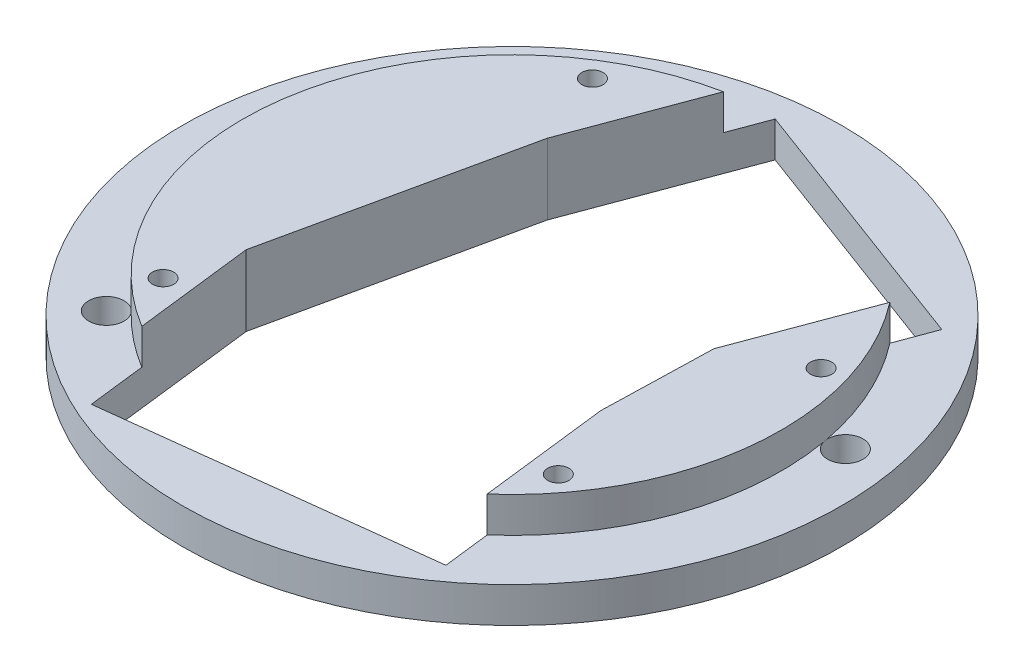
ISO-10303-21;
HEADER;
FILE_DESCRIPTION(('STEP AP214'),'2;1');
FILE_NAME('part.step','',(''),(''),'','','');
FILE_SCHEMA(('AUTOMOTIVE_DESIGN { 1 0 10303 214 1 1 1 1 }'));
ENDSEC;
DATA;
#1=APPLICATION_CONTEXT('core data for automotive mechanical design processes');
#2=APPLICATION_PROTOCOL_DEFINITION('international standard','automotive_design',2000,#1);
#3=PRODUCT_CONTEXT('',#1,'mechanical');
#4=PRODUCT('Part','Part','',(#3));
#5=PRODUCT_RELATED_PRODUCT_CATEGORY('part','',(#4));
#6=PRODUCT_DEFINITION_FORMATION('','',#4);
#7=PRODUCT_DEFINITION_CONTEXT('part definition',#1,'design');
#8=PRODUCT_DEFINITION('design','',#6,#7);
#9=PRODUCT_DEFINITION_SHAPE('','',#8);
#10=(LENGTH_UNIT() NAMED_UNIT(*) SI_UNIT(.MILLI.,.METRE.));
#11=(NAMED_UNIT(*) PLANE_ANGLE_UNIT() SI_UNIT($,.RADIAN.));
#12=(NAMED_UNIT(*) SI_UNIT($,.STERADIAN.) SOLID_ANGLE_UNIT());
#13=UNCERTAINTY_MEASURE_WITH_UNIT(LENGTH_MEASURE(1.E-05),#10,'distance_accuracy_value','');
#14=(GEOMETRIC_REPRESENTATION_CONTEXT(3) GLOBAL_UNCERTAINTY_ASSIGNED_CONTEXT((#13)) GLOBAL_UNIT_ASSIGNED_CONTEXT((#10,
#11,#12)) REPRESENTATION_CONTEXT('',''));
#15=CARTESIAN_POINT('',(0.,0.,0.));
#16=DIRECTION('',(0.,0.,1.));
#17=DIRECTION('',(1.,0.,0.));
#18=AXIS2_PLACEMENT_3D('',#15,#16,#17);
#19=CARTESIAN_POINT('',(-2.83521131428288,10.,0.));
#20=DIRECTION('',(0.,1.,0.));
#21=DIRECTION('',(0.,0.,1.));
#22=AXIS2_PLACEMENT_3D('',#19,#20,#21);
#23=PLANE('',#22);
#24=DIRECTION('',(0.0271610970881817,0.,-0.99963106934757));
#25=VECTOR('',#24,1.);
#26=CARTESIAN_POINT('',(20.4650387311431,10.,-5.1898694392139));
#27=LINE('',#26,#25);
#28=CARTESIAN_POINT('',(20.042712500142,10.,10.3533326832382));
#29=VERTEX_POINT('',#28);
#30=CARTESIAN_POINT('',(20.4650387311431,10.,-5.1898694392139));
#31=VERTEX_POINT('',#30);
#32=EDGE_CURVE('E160',#29,#31,#27,.T.);
#33=ORIENTED_EDGE('',*,*,#32,.F.);
#34=DIRECTION('',(-0.118896593610354,0.,-0.992906642151141));
#35=VECTOR('',#34,1.);
#36=CARTESIAN_POINT('',(18.4970567832074,10.,-2.55445366472666));
#37=LINE('',#36,#35);
#38=CARTESIAN_POINT('',(22.2236809974988,10.,28.5666224133433));
#39=VERTEX_POINT('',#38);
#40=EDGE_CURVE('E13',#39,#29,#37,.T.);
#41=ORIENTED_EDGE('',*,*,#40,.F.);
#42=CARTESIAN_POINT('',(-2.83521131428288,10.,0.));
#43=DIRECTION('',(0.,1.,0.));
#44=DIRECTION('',(0.,0.,1.));
#45=AXIS2_PLACEMENT_3D('',#42,#43,#44);
#46=CIRCLE('',#45,38.);
#47=CARTESIAN_POINT('',(27.204272032586,10.,-23.2729336408882));
#48=VERTEX_POINT('',#47);
#49=EDGE_CURVE('E255',#39,#48,#46,.T.);
#50=ORIENTED_EDGE('',*,*,#49,.T.);
#51=DIRECTION('',(0.34921847701237,0.,-0.937041330632305));
#52=VECTOR('',#51,1.);
#53=CARTESIAN_POINT('',(29.1955006564524,10.,-28.6159027050215));
#54=LINE('',#53,#52);
#55=EDGE_CURVE('E187',#31,#48,#54,.T.);
#56=ORIENTED_EDGE('',*,*,#55,.F.);
#57=EDGE_LOOP('',(#33,#41,#50,#56));
#58=FACE_BOUND('',#57,.T.);
#59=CARTESIAN_POINT('',(24.8337846457272,10.,21.1365462089214));
#60=DIRECTION('',(0.,1.,0.));
#61=DIRECTION('',(0.,0.,1.));
#62=AXIS2_PLACEMENT_3D('',#59,#60,#61);
#63=CIRCLE('',#62,1.5);
#64=CARTESIAN_POINT('',(24.8337846457272,10.,22.6365462089214));
#65=VERTEX_POINT('',#64);
#66=EDGE_CURVE('E219',#65,#65,#63,.T.);
#67=ORIENTED_EDGE('',*,*,#66,.F.);
#68=EDGE_LOOP('',(#67));
#69=FACE_BOUND('',#68,.T.);
#70=CARTESIAN_POINT('',(30.4014959552903,10.,-10.3753656780677));
#71=DIRECTION('',(0.,1.,0.));
#72=DIRECTION('',(0.,0.,1.));
#73=AXIS2_PLACEMENT_3D('',#70,#71,#72);
#74=CIRCLE('',#73,1.5);
#75=CARTESIAN_POINT('',(30.4014959552903,10.,-8.87536567806766));
#76=VERTEX_POINT('',#75);
#77=EDGE_CURVE('E213',#76,#76,#74,.T.);
#78=ORIENTED_EDGE('',*,*,#77,.F.);
#79=EDGE_LOOP('',(#78));
#80=FACE_BOUND('',#79,.T.);
#81=ADVANCED_FACE('F44',(#58,#69,#80),#23,.T.);
#82=CARTESIAN_POINT('',(-2.83521131428288,10.,0.));
#83=DIRECTION('',(0.,-1.,0.));
#84=DIRECTION('',(0.,0.,-1.));
#85=AXIS2_PLACEMENT_3D('',#82,#83,#84);
#86=CYLINDRICAL_SURFACE('',#85,38.);
#87=ORIENTED_EDGE('',*,*,#49,.F.);
#88=DIRECTION('',(0.,-1.,0.));
#89=VECTOR('',#88,1.);
#90=CARTESIAN_POINT('',(22.2236809974988,10.,28.5666224133433));
#91=LINE('',#90,#89);
#92=CARTESIAN_POINT('',(22.2236809974988,5.,28.5666224133433));
#93=VERTEX_POINT('',#92);
#94=EDGE_CURVE('E393',#39,#93,#91,.T.);
#95=ORIENTED_EDGE('',*,*,#94,.T.);
#96=CARTESIAN_POINT('',(-2.83521131428288,5.,0.));
#97=DIRECTION('',(0.,1.,0.));
#98=DIRECTION('',(0.,0.,1.));
#99=AXIS2_PLACEMENT_3D('',#96,#97,#98);
#100=CIRCLE('',#99,38.);
#101=CARTESIAN_POINT('',(34.6121261363601,5.,-6.45731506569657));
#102=VERTEX_POINT('',#101);
#103=EDGE_CURVE('E260',#93,#102,#100,.T.);
#104=ORIENTED_EDGE('',*,*,#103,.T.);
#105=CARTESIAN_POINT('',(34.5027051133886,5.,-7.06257720950504));
#106=VERTEX_POINT('',#105);
#107=EDGE_CURVE('E359',#102,#106,#100,.T.);
#108=ORIENTED_EDGE('',*,*,#107,.T.);
#109=CARTESIAN_POINT('',(27.204272032586,5.,-23.2729336408882));
#110=VERTEX_POINT('',#109);
#111=EDGE_CURVE('E357',#106,#110,#100,.T.);
#112=ORIENTED_EDGE('',*,*,#111,.T.);
#113=DIRECTION('',(0.,-1.,0.));
#114=VECTOR('',#113,1.);
#115=CARTESIAN_POINT('',(27.204272032586,10.,-23.2729336408882));
#116=LINE('',#115,#114);
#117=EDGE_CURVE('E170',#110,#48,#116,.F.);
#118=ORIENTED_EDGE('',*,*,#117,.T.);
#119=EDGE_LOOP('',(#87,#95,#104,#108,#112,#118));
#120=FACE_BOUND('',#119,.T.);
#121=ADVANCED_FACE('F278',(#120),#86,.T.);
#122=CARTESIAN_POINT('',(-2.83521131428288,5.,0.));
#123=DIRECTION('',(0.,-1.,0.));
#124=DIRECTION('',(0.,0.,-1.));
#125=AXIS2_PLACEMENT_3D('',#122,#123,#124);
#126=CYLINDRICAL_SURFACE('',#125,46.5);
#127=CARTESIAN_POINT('',(-2.83521131428288,5.,0.));
#128=DIRECTION('',(0.,1.,0.));
#129=DIRECTION('',(0.,0.,1.));
#130=AXIS2_PLACEMENT_3D('',#127,#128,#129);
#131=CIRCLE('',#130,46.5);
#132=CARTESIAN_POINT('',(-2.83521131428288,5.,46.5));
#133=VERTEX_POINT('',#132);
#134=EDGE_CURVE('E261',#133,#133,#131,.T.);
#135=ORIENTED_EDGE('',*,*,#134,.F.);
#136=EDGE_LOOP('',(#135));
#137=FACE_BOUND('',#136,.T.);
#138=CARTESIAN_POINT('',(-2.83521131428288,0.,0.));
#139=DIRECTION('',(0.,1.,0.));
#140=DIRECTION('',(0.,0.,1.));
#141=AXIS2_PLACEMENT_3D('',#138,#139,#140);
#142=CIRCLE('',#141,46.5);
#143=CARTESIAN_POINT('',(-2.83521131428288,0.,46.5));
#144=VERTEX_POINT('',#143);
#145=EDGE_CURVE('E254',#144,#144,#142,.T.);
#146=ORIENTED_EDGE('',*,*,#145,.T.);
#147=EDGE_LOOP('',(#146));
#148=FACE_BOUND('',#147,.T.);
#149=ADVANCED_FACE('F46',(#137,#148),#126,.T.);
#150=CARTESIAN_POINT('',(-2.83521131428288,5.,0.));
#151=DIRECTION('',(0.,1.,0.));
#152=DIRECTION('',(0.,0.,1.));
#153=AXIS2_PLACEMENT_3D('',#150,#151,#152);
#154=PLANE('',#153);
#155=DIRECTION('',(-0.118896593610354,0.,-0.992906642151141));
#156=VECTOR('',#155,1.);
#157=CARTESIAN_POINT('',(18.4970567832074,5.,-2.55445366472666));
#158=LINE('',#157,#156);
#159=CARTESIAN_POINT('',(23.0151273404009,5.,35.1759987370167));
#160=VERTEX_POINT('',#159);
#161=EDGE_CURVE('E189',#160,#93,#158,.T.);
#162=ORIENTED_EDGE('',*,*,#161,.F.);
#163=DIRECTION('',(0.992906642151141,0.,-0.118896593610354));
#164=VECTOR('',#163,1.);
#165=CARTESIAN_POINT('',(1.68285924291057,5.,37.7304524017434));
#166=LINE('',#165,#164);
#167=CARTESIAN_POINT('',(-21.6656715564005,5.,40.5263454494826));
#168=VERTEX_POINT('',#167);
#169=EDGE_CURVE('E385',#168,#160,#166,.T.);
#170=ORIENTED_EDGE('',*,*,#169,.F.);
#171=DIRECTION('',(0.118896593610354,0.,0.992906642151141));
#172=VECTOR('',#171,1.);
#173=CARTESIAN_POINT('',(-26.1837421135939,5.,2.79589304773927));
#174=LINE('',#173,#172);
#175=CARTESIAN_POINT('',(-22.6346656667726,5.,32.4342659442706));
#176=VERTEX_POINT('',#175);
#177=EDGE_CURVE('E382',#176,#168,#174,.T.);
#178=ORIENTED_EDGE('',*,*,#177,.F.);
#179=CARTESIAN_POINT('',(-30.0169888186709,5.,26.5546789041394));
#180=VERTEX_POINT('',#179);
#181=EDGE_CURVE('E360',#180,#176,#100,.T.);
#182=ORIENTED_EDGE('',*,*,#181,.F.);
#183=CARTESIAN_POINT('',(-32.0187761800075,5.,28.0522927929615));
#184=DIRECTION('',(0.,1.,0.));
#185=DIRECTION('',(0.,0.,1.));
#186=AXIS2_PLACEMENT_3D('',#183,#184,#185);
#187=CIRCLE('',#186,2.5);
#188=CARTESIAN_POINT('',(-30.4432318195107,5.,26.1112466914723));
#189=VERTEX_POINT('',#188);
#190=EDGE_CURVE('E241',#189,#180,#187,.T.);
#191=ORIENTED_EDGE('',*,*,#190,.F.);
#192=CARTESIAN_POINT('',(-20.3941624962256,5.,-33.6998996050456));
#193=VERTEX_POINT('',#192);
#194=EDGE_CURVE('E259',#193,#189,#100,.T.);
#195=ORIENTED_EDGE('',*,*,#194,.F.);
#196=CARTESIAN_POINT('',(-21.2488615842367,5.,-36.0492589792055));
#197=DIRECTION('',(0.,1.,0.));
#198=DIRECTION('',(0.,0.,1.));
#199=AXIS2_PLACEMENT_3D('',#196,#197,#198);
#200=CIRCLE('',#199,2.5);
#201=CARTESIAN_POINT('',(-19.8464088976606,5.,-33.9796874143846));
#202=VERTEX_POINT('',#201);
#203=EDGE_CURVE('E233',#202,#193,#200,.T.);
#204=ORIENTED_EDGE('',*,*,#203,.F.);
#205=CARTESIAN_POINT('',(-10.2683156977392,5.,-37.2659222242606));
#206=VERTEX_POINT('',#205);
#207=EDGE_CURVE('E247',#206,#202,#100,.T.);
#208=ORIENTED_EDGE('',*,*,#207,.F.);
#209=DIRECTION('',(-0.34921847701237,0.,0.937041330632305));
#210=VECTOR('',#209,1.);
#211=CARTESIAN_POINT('',(-21.5564299864638,5.,-6.97706201294549));
#212=LINE('',#211,#210);
#213=CARTESIAN_POINT('',(-8.28612785999372,5.,-42.5846325769731));
#214=VERTEX_POINT('',#213);
#215=EDGE_CURVE('E203',#214,#206,#212,.T.);
#216=ORIENTED_EDGE('',*,*,#215,.F.);
#217=DIRECTION('',(-0.937041330632305,0.,-0.34921847701237));
#218=VECTOR('',#217,1.);
#219=CARTESIAN_POINT('',(10.4350908121872,5.,-35.6075705640276));
#220=LINE('',#219,#218);
#221=CARTESIAN_POINT('',(29.1955006564524,5.,-28.6159027050215));
#222=VERTEX_POINT('',#221);
#223=EDGE_CURVE('E198',#222,#214,#220,.T.);
#224=ORIENTED_EDGE('',*,*,#223,.F.);
#225=DIRECTION('',(0.34921847701237,0.,-0.937041330632305));
#226=VECTOR('',#225,1.);
#227=CARTESIAN_POINT('',(15.9251985299823,5.,6.99166785900607));
#228=LINE('',#227,#226);
#229=EDGE_CURVE('E196',#110,#222,#228,.T.);
#230=ORIENTED_EDGE('',*,*,#229,.F.);
#231=ORIENTED_EDGE('',*,*,#111,.F.);
#232=CARTESIAN_POINT('',(36.9988524501873,5.,-7.20131607569916));
#233=DIRECTION('',(0.,1.,0.));
#234=DIRECTION('',(0.,0.,1.));
#235=AXIS2_PLACEMENT_3D('',#232,#233,#234);
#236=CIRCLE('',#235,2.5);
#237=EDGE_CURVE('E234',#102,#106,#236,.T.);
#238=ORIENTED_EDGE('',*,*,#237,.F.);
#239=ORIENTED_EDGE('',*,*,#103,.F.);
#240=EDGE_LOOP('',(#162,#170,#178,#182,#191,#195,#204,#208,#216,#224,#230,#231,#238,#239));
#241=FACE_BOUND('',#240,.T.);
#242=ORIENTED_EDGE('',*,*,#134,.T.);
#243=EDGE_LOOP('',(#242));
#244=FACE_BOUND('',#243,.T.);
#245=ADVANCED_FACE('F270',(#241,#244),#154,.T.);
#246=CARTESIAN_POINT('',(-2.83521131428288,0.,0.));
#247=DIRECTION('',(0.,1.,0.));
#248=DIRECTION('',(0.,0.,1.));
#249=AXIS2_PLACEMENT_3D('',#246,#247,#248);
#250=PLANE('',#249);
#251=DIRECTION('',(-0.118896593610354,0.,-0.992906642151141));
#252=VECTOR('',#251,1.);
#253=CARTESIAN_POINT('',(23.0151273404009,0.,35.1759987370167));
#254=LINE('',#253,#252);
#255=CARTESIAN_POINT('',(23.0151273404009,0.,35.1759987370167));
#256=VERTEX_POINT('',#255);
#257=CARTESIAN_POINT('',(20.042712500142,0.,10.3533326832382));
#258=VERTEX_POINT('',#257);
#259=EDGE_CURVE('E408',#256,#258,#254,.T.);
#260=ORIENTED_EDGE('',*,*,#259,.T.);
#261=DIRECTION('',(0.0271610970881817,0.,-0.99963106934757));
#262=VECTOR('',#261,1.);
#263=CARTESIAN_POINT('',(20.4650387311431,0.,-5.1898694392139));
#264=LINE('',#263,#262);
#265=CARTESIAN_POINT('',(20.4650387311431,0.,-5.1898694392139));
#266=VERTEX_POINT('',#265);
#267=EDGE_CURVE('E159',#258,#266,#264,.T.);
#268=ORIENTED_EDGE('',*,*,#267,.T.);
#269=DIRECTION('',(0.34921847701237,0.,-0.937041330632305));
#270=VECTOR('',#269,1.);
#271=CARTESIAN_POINT('',(29.1955006564524,0.,-28.6159027050215));
#272=LINE('',#271,#270);
#273=CARTESIAN_POINT('',(29.1955006564524,0.,-28.6159027050215));
#274=VERTEX_POINT('',#273);
#275=EDGE_CURVE('E183',#266,#274,#272,.T.);
#276=ORIENTED_EDGE('',*,*,#275,.T.);
#277=DIRECTION('',(-0.937041330632305,0.,-0.34921847701237));
#278=VECTOR('',#277,1.);
#279=CARTESIAN_POINT('',(-8.28612785999372,0.,-42.5846325769731));
#280=LINE('',#279,#278);
#281=CARTESIAN_POINT('',(-8.28612785999372,0.,-42.5846325769731));
#282=VERTEX_POINT('',#281);
#283=EDGE_CURVE('E177',#274,#282,#280,.T.);
#284=ORIENTED_EDGE('',*,*,#283,.T.);
#285=DIRECTION('',(-0.34921847701237,0.,0.937041330632305));
#286=VECTOR('',#285,1.);
#287=CARTESIAN_POINT('',(-17.016589785303,0.,-19.1585993111655));
#288=LINE('',#287,#286);
#289=CARTESIAN_POINT('',(-17.016589785303,0.,-19.1585993111655));
#290=VERTEX_POINT('',#289);
#291=EDGE_CURVE('E167',#282,#290,#288,.T.);
#292=ORIENTED_EDGE('',*,*,#291,.T.);
#293=DIRECTION('',(-0.213573142088404,0.,0.976927076591946));
#294=VECTOR('',#293,1.);
#295=CARTESIAN_POINT('',(-17.016589785303,0.,-19.1585993111655));
#296=LINE('',#295,#294);
#297=CARTESIAN_POINT('',(-24.6380863966593,0.,15.7036793957041));
#298=VERTEX_POINT('',#297);
#299=EDGE_CURVE('E150',#290,#298,#296,.T.);
#300=ORIENTED_EDGE('',*,*,#299,.T.);
#301=DIRECTION('',(0.118896593610354,0.,0.992906642151141));
#302=VECTOR('',#301,1.);
#303=CARTESIAN_POINT('',(-24.6380863966593,0.,15.7036793957041));
#304=LINE('',#303,#302);
#305=CARTESIAN_POINT('',(-21.6656715564005,0.,40.5263454494826));
#306=VERTEX_POINT('',#305);
#307=EDGE_CURVE('E412',#298,#306,#304,.T.);
#308=ORIENTED_EDGE('',*,*,#307,.T.);
#309=DIRECTION('',(0.992906642151141,0.,-0.118896593610354));
#310=VECTOR('',#309,1.);
#311=CARTESIAN_POINT('',(-21.6656715564005,0.,40.5263454494826));
#312=LINE('',#311,#310);
#313=EDGE_CURVE('E59',#306,#256,#312,.T.);
#314=ORIENTED_EDGE('',*,*,#313,.T.);
#315=EDGE_LOOP('',(#260,#268,#276,#284,#292,#300,#308,#314));
#316=FACE_BOUND('',#315,.T.);
#317=CARTESIAN_POINT('',(-21.1169446181786,0.,-29.6328390553817));
#318=DIRECTION('',(0.,1.,0.));
#319=DIRECTION('',(0.,0.,1.));
#320=AXIS2_PLACEMENT_3D('',#317,#318,#319);
#321=CIRCLE('',#320,1.5);
#322=CARTESIAN_POINT('',(-21.1169446181786,0.,-28.1328390553817));
#323=VERTEX_POINT('',#322);
#324=EDGE_CURVE('E210',#323,#323,#321,.T.);
#325=ORIENTED_EDGE('',*,*,#324,.T.);
#326=EDGE_LOOP('',(#325));
#327=FACE_BOUND('',#326,.T.);
#328=CARTESIAN_POINT('',(30.4014959552903,0.,-10.3753656780677));
#329=DIRECTION('',(0.,1.,0.));
#330=DIRECTION('',(0.,0.,1.));
#331=AXIS2_PLACEMENT_3D('',#328,#329,#330);
#332=CIRCLE('',#331,1.5);
#333=CARTESIAN_POINT('',(30.4014959552903,0.,-8.87536567806766));
#334=VERTEX_POINT('',#333);
#335=EDGE_CURVE('E216',#334,#334,#332,.T.);
#336=ORIENTED_EDGE('',*,*,#335,.T.);
#337=EDGE_LOOP('',(#336));
#338=FACE_BOUND('',#337,.T.);
#339=CARTESIAN_POINT('',(24.8337846457272,0.,21.1365462089214));
#340=DIRECTION('',(0.,1.,0.));
#341=DIRECTION('',(0.,0.,1.));
#342=AXIS2_PLACEMENT_3D('',#339,#340,#341);
#343=CIRCLE('',#342,1.5);
#344=CARTESIAN_POINT('',(24.8337846457272,0.,22.6365462089214));
#345=VERTEX_POINT('',#344);
#346=EDGE_CURVE('E205',#345,#345,#343,.T.);
#347=ORIENTED_EDGE('',*,*,#346,.T.);
#348=EDGE_LOOP('',(#347));
#349=FACE_BOUND('',#348,.T.);
#350=CARTESIAN_POINT('',(-27.0187761800075,0.,25.049593079773));
#351=DIRECTION('',(0.,1.,0.));
#352=DIRECTION('',(0.,0.,1.));
#353=AXIS2_PLACEMENT_3D('',#350,#351,#352);
#354=CIRCLE('',#353,1.5);
#355=CARTESIAN_POINT('',(-27.0187761800075,0.,26.549593079773));
#356=VERTEX_POINT('',#355);
#357=EDGE_CURVE('E224',#356,#356,#354,.T.);
#358=ORIENTED_EDGE('',*,*,#357,.T.);
#359=EDGE_LOOP('',(#358));
#360=FACE_BOUND('',#359,.T.);
#361=CARTESIAN_POINT('',(36.9988524501873,0.,-7.20131607569916));
#362=DIRECTION('',(0.,1.,0.));
#363=DIRECTION('',(0.,0.,1.));
#364=AXIS2_PLACEMENT_3D('',#361,#362,#363);
#365=CIRCLE('',#364,2.5);
#366=CARTESIAN_POINT('',(36.9988524501873,0.,-4.70131607569916));
#367=VERTEX_POINT('',#366);
#368=EDGE_CURVE('E235',#367,#367,#365,.T.);
#369=ORIENTED_EDGE('',*,*,#368,.T.);
#370=EDGE_LOOP('',(#369));
#371=FACE_BOUND('',#370,.T.);
#372=CARTESIAN_POINT('',(-32.0187761800075,0.,28.0522927929615));
#373=DIRECTION('',(0.,1.,0.));
#374=DIRECTION('',(0.,0.,1.));
#375=AXIS2_PLACEMENT_3D('',#372,#373,#374);
#376=CIRCLE('',#375,2.5);
#377=CARTESIAN_POINT('',(-32.0187761800075,0.,30.5522927929615));
#378=VERTEX_POINT('',#377);
#379=EDGE_CURVE('E227',#378,#378,#376,.T.);
#380=ORIENTED_EDGE('',*,*,#379,.T.);
#381=EDGE_LOOP('',(#380));
#382=FACE_BOUND('',#381,.T.);
#383=CARTESIAN_POINT('',(-21.2488615842367,0.,-36.0492589792055));
#384=DIRECTION('',(0.,1.,0.));
#385=DIRECTION('',(0.,0.,1.));
#386=AXIS2_PLACEMENT_3D('',#383,#384,#385);
#387=CIRCLE('',#386,2.5);
#388=CARTESIAN_POINT('',(-21.2488615842367,0.,-33.5492589792055));
#389=VERTEX_POINT('',#388);
#390=EDGE_CURVE('E244',#389,#389,#387,.T.);
#391=ORIENTED_EDGE('',*,*,#390,.T.);
#392=EDGE_LOOP('',(#391));
#393=FACE_BOUND('',#392,.T.);
#394=ORIENTED_EDGE('',*,*,#145,.F.);
#395=EDGE_LOOP('',(#394));
#396=FACE_BOUND('',#395,.T.);
#397=ADVANCED_FACE('F174',(#316,#327,#338,#349,#360,#371,#382,#393,#396),#250,.F.);
#398=ORIENTED_EDGE('',*,*,#181,.T.);
#399=DIRECTION('',(0.,-1.,0.));
#400=VECTOR('',#399,1.);
#401=CARTESIAN_POINT('',(-22.6346656667726,10.,32.4342659442706));
#402=LINE('',#401,#400);
#403=CARTESIAN_POINT('',(-22.6346656667726,10.,32.4342659442706));
#404=VERTEX_POINT('',#403);
#405=EDGE_CURVE('E379',#176,#404,#402,.F.);
#406=ORIENTED_EDGE('',*,*,#405,.T.);
#407=CARTESIAN_POINT('',(-10.2683156977392,10.,-37.2659222242606));
#408=VERTEX_POINT('',#407);
#409=EDGE_CURVE('E251',#408,#404,#46,.T.);
#410=ORIENTED_EDGE('',*,*,#409,.F.);
#411=DIRECTION('',(0.,-1.,0.));
#412=VECTOR('',#411,1.);
#413=CARTESIAN_POINT('',(-10.2683156977392,10.,-37.2659222242606));
#414=LINE('',#413,#412);
#415=EDGE_CURVE('E200',#408,#206,#414,.T.);
#416=ORIENTED_EDGE('',*,*,#415,.T.);
#417=ORIENTED_EDGE('',*,*,#207,.T.);
#418=EDGE_CURVE('E256',#202,#193,#100,.T.);
#419=ORIENTED_EDGE('',*,*,#418,.T.);
#420=ORIENTED_EDGE('',*,*,#194,.T.);
#421=EDGE_CURVE('E354',#189,#180,#100,.T.);
#422=ORIENTED_EDGE('',*,*,#421,.T.);
#423=EDGE_LOOP('',(#398,#406,#410,#416,#417,#419,#420,#422));
#424=FACE_BOUND('',#423,.T.);
#425=ADVANCED_FACE('F269',(#424),#86,.T.);
#426=DIRECTION('',(-0.213573142088404,0.,0.976927076591946));
#427=VECTOR('',#426,1.);
#428=CARTESIAN_POINT('',(-17.016589785303,10.,-19.1585993111655));
#429=LINE('',#428,#427);
#430=CARTESIAN_POINT('',(-17.016589785303,10.,-19.1585993111655));
#431=VERTEX_POINT('',#430);
#432=CARTESIAN_POINT('',(-24.6380863966593,10.,15.7036793957041));
#433=VERTEX_POINT('',#432);
#434=EDGE_CURVE('E67',#431,#433,#429,.T.);
#435=ORIENTED_EDGE('',*,*,#434,.F.);
#436=DIRECTION('',(-0.34921847701237,0.,0.937041330632305));
#437=VECTOR('',#436,1.);
#438=CARTESIAN_POINT('',(-21.5564299864638,10.,-6.97706201294549));
#439=LINE('',#438,#437);
#440=EDGE_CURVE('E52',#408,#431,#439,.T.);
#441=ORIENTED_EDGE('',*,*,#440,.F.);
#442=ORIENTED_EDGE('',*,*,#409,.T.);
#443=DIRECTION('',(0.118896593610354,0.,0.992906642151141));
#444=VECTOR('',#443,1.);
#445=CARTESIAN_POINT('',(-24.6380863966593,10.,15.7036793957041));
#446=LINE('',#445,#444);
#447=EDGE_CURVE('E410',#433,#404,#446,.T.);
#448=ORIENTED_EDGE('',*,*,#447,.F.);
#449=EDGE_LOOP('',(#435,#441,#442,#448));
#450=FACE_BOUND('',#449,.T.);
#451=CARTESIAN_POINT('',(-21.1169446181786,10.,-29.6328390553817));
#452=DIRECTION('',(0.,1.,0.));
#453=DIRECTION('',(0.,0.,1.));
#454=AXIS2_PLACEMENT_3D('',#451,#452,#453);
#455=CIRCLE('',#454,1.5);
#456=CARTESIAN_POINT('',(-21.1169446181786,10.,-28.1328390553817));
#457=VERTEX_POINT('',#456);
#458=EDGE_CURVE('E206',#457,#457,#455,.T.);
#459=ORIENTED_EDGE('',*,*,#458,.F.);
#460=EDGE_LOOP('',(#459));
#461=FACE_BOUND('',#460,.T.);
#462=CARTESIAN_POINT('',(-27.0187761800075,10.,25.049593079773));
#463=DIRECTION('',(0.,1.,0.));
#464=DIRECTION('',(0.,0.,1.));
#465=AXIS2_PLACEMENT_3D('',#462,#463,#464);
#466=CIRCLE('',#465,1.5);
#467=CARTESIAN_POINT('',(-27.0187761800075,10.,26.549593079773));
#468=VERTEX_POINT('',#467);
#469=EDGE_CURVE('E209',#468,#468,#466,.T.);
#470=ORIENTED_EDGE('',*,*,#469,.F.);
#471=EDGE_LOOP('',(#470));
#472=FACE_BOUND('',#471,.T.);
#473=ADVANCED_FACE('F275',(#450,#461,#472),#23,.T.);
#474=CARTESIAN_POINT('',(-21.2488615842367,5.,-36.0492589792055));
#475=DIRECTION('',(0.,1.,0.));
#476=DIRECTION('',(0.,0.,1.));
#477=AXIS2_PLACEMENT_3D('',#474,#475,#476);
#478=PLANE('',#477);
#479=EDGE_CURVE('E248',#193,#202,#200,.T.);
#480=ORIENTED_EDGE('',*,*,#479,.F.);
#481=ORIENTED_EDGE('',*,*,#418,.F.);
#482=EDGE_LOOP('',(#480,#481));
#483=FACE_BOUND('',#482,.T.);
#484=ADVANCED_FACE('F292',(#483),#478,.F.);
#485=CARTESIAN_POINT('',(-21.2488615842367,0.,-36.0492589792055));
#486=DIRECTION('',(0.,1.,0.));
#487=DIRECTION('',(0.,0.,1.));
#488=AXIS2_PLACEMENT_3D('',#485,#486,#487);
#489=CYLINDRICAL_SURFACE('',#488,2.5);
#490=ORIENTED_EDGE('',*,*,#390,.F.);
#491=EDGE_LOOP('',(#490));
#492=FACE_BOUND('',#491,.T.);
#493=ORIENTED_EDGE('',*,*,#479,.T.);
#494=ORIENTED_EDGE('',*,*,#203,.T.);
#495=EDGE_LOOP('',(#493,#494));
#496=FACE_BOUND('',#495,.T.);
#497=ADVANCED_FACE('F297',(#492,#496),#489,.F.);
#498=CARTESIAN_POINT('',(-32.0187761800075,5.,28.0522927929615));
#499=DIRECTION('',(0.,1.,0.));
#500=DIRECTION('',(0.,0.,1.));
#501=AXIS2_PLACEMENT_3D('',#498,#499,#500);
#502=PLANE('',#501);
#503=EDGE_CURVE('E238',#180,#189,#187,.T.);
#504=ORIENTED_EDGE('',*,*,#503,.F.);
#505=ORIENTED_EDGE('',*,*,#421,.F.);
#506=EDGE_LOOP('',(#504,#505));
#507=FACE_BOUND('',#506,.T.);
#508=ADVANCED_FACE('F331',(#507),#502,.F.);
#509=CARTESIAN_POINT('',(-32.0187761800075,0.,28.0522927929615));
#510=DIRECTION('',(0.,1.,0.));
#511=DIRECTION('',(0.,0.,1.));
#512=AXIS2_PLACEMENT_3D('',#509,#510,#511);
#513=CYLINDRICAL_SURFACE('',#512,2.5);
#514=ORIENTED_EDGE('',*,*,#379,.F.);
#515=EDGE_LOOP('',(#514));
#516=FACE_BOUND('',#515,.T.);
#517=ORIENTED_EDGE('',*,*,#503,.T.);
#518=ORIENTED_EDGE('',*,*,#190,.T.);
#519=EDGE_LOOP('',(#517,#518));
#520=FACE_BOUND('',#519,.T.);
#521=ADVANCED_FACE('F327',(#516,#520),#513,.F.);
#522=CARTESIAN_POINT('',(36.9988524501873,5.,-7.20131607569916));
#523=DIRECTION('',(0.,1.,0.));
#524=DIRECTION('',(0.,0.,1.));
#525=AXIS2_PLACEMENT_3D('',#522,#523,#524);
#526=PLANE('',#525);
#527=EDGE_CURVE('E230',#106,#102,#236,.T.);
#528=ORIENTED_EDGE('',*,*,#527,.F.);
#529=ORIENTED_EDGE('',*,*,#107,.F.);
#530=EDGE_LOOP('',(#528,#529));
#531=FACE_BOUND('',#530,.T.);
#532=ADVANCED_FACE('F319',(#531),#526,.F.);
#533=CARTESIAN_POINT('',(36.9988524501873,0.,-7.20131607569916));
#534=DIRECTION('',(0.,1.,0.));
#535=DIRECTION('',(0.,0.,1.));
#536=AXIS2_PLACEMENT_3D('',#533,#534,#535);
#537=CYLINDRICAL_SURFACE('',#536,2.5);
#538=ORIENTED_EDGE('',*,*,#368,.F.);
#539=EDGE_LOOP('',(#538));
#540=FACE_BOUND('',#539,.T.);
#541=ORIENTED_EDGE('',*,*,#527,.T.);
#542=ORIENTED_EDGE('',*,*,#237,.T.);
#543=EDGE_LOOP('',(#541,#542));
#544=FACE_BOUND('',#543,.T.);
#545=ADVANCED_FACE('F309',(#540,#544),#537,.F.);
#546=CARTESIAN_POINT('',(-27.0187761800075,0.,25.049593079773));
#547=DIRECTION('',(0.,1.,0.));
#548=DIRECTION('',(0.,0.,1.));
#549=AXIS2_PLACEMENT_3D('',#546,#547,#548);
#550=CYLINDRICAL_SURFACE('',#549,1.5);
#551=ORIENTED_EDGE('',*,*,#357,.F.);
#552=EDGE_LOOP('',(#551));
#553=FACE_BOUND('',#552,.T.);
#554=ORIENTED_EDGE('',*,*,#469,.T.);
#555=EDGE_LOOP('',(#554));
#556=FACE_BOUND('',#555,.T.);
#557=ADVANCED_FACE('F306',(#553,#556),#550,.F.);
#558=CARTESIAN_POINT('',(24.8337846457272,0.,21.1365462089214));
#559=DIRECTION('',(0.,1.,0.));
#560=DIRECTION('',(0.,0.,1.));
#561=AXIS2_PLACEMENT_3D('',#558,#559,#560);
#562=CYLINDRICAL_SURFACE('',#561,1.5);
#563=ORIENTED_EDGE('',*,*,#346,.F.);
#564=EDGE_LOOP('',(#563));
#565=FACE_BOUND('',#564,.T.);
#566=ORIENTED_EDGE('',*,*,#66,.T.);
#567=EDGE_LOOP('',(#566));
#568=FACE_BOUND('',#567,.T.);
#569=ADVANCED_FACE('F308',(#565,#568),#562,.F.);
#570=CARTESIAN_POINT('',(30.4014959552903,0.,-10.3753656780677));
#571=DIRECTION('',(0.,1.,0.));
#572=DIRECTION('',(0.,0.,1.));
#573=AXIS2_PLACEMENT_3D('',#570,#571,#572);
#574=CYLINDRICAL_SURFACE('',#573,1.5);
#575=ORIENTED_EDGE('',*,*,#335,.F.);
#576=EDGE_LOOP('',(#575));
#577=FACE_BOUND('',#576,.T.);
#578=ORIENTED_EDGE('',*,*,#77,.T.);
#579=EDGE_LOOP('',(#578));
#580=FACE_BOUND('',#579,.T.);
#581=ADVANCED_FACE('F316',(#577,#580),#574,.F.);
#582=CARTESIAN_POINT('',(-21.1169446181786,0.,-29.6328390553817));
#583=DIRECTION('',(0.,1.,0.));
#584=DIRECTION('',(0.,0.,1.));
#585=AXIS2_PLACEMENT_3D('',#582,#583,#584);
#586=CYLINDRICAL_SURFACE('',#585,1.5);
#587=ORIENTED_EDGE('',*,*,#324,.F.);
#588=EDGE_LOOP('',(#587));
#589=FACE_BOUND('',#588,.T.);
#590=ORIENTED_EDGE('',*,*,#458,.T.);
#591=EDGE_LOOP('',(#590));
#592=FACE_BOUND('',#591,.T.);
#593=ADVANCED_FACE('F432',(#589,#592),#586,.F.);
#594=CARTESIAN_POINT('',(-17.016589785303,0.,-19.1585993111655));
#595=DIRECTION('',(-0.937041330632305,0.,-0.34921847701237));
#596=DIRECTION('',(-0.34921847701237,0.,0.937041330632305));
#597=AXIS2_PLACEMENT_3D('',#594,#595,#596);
#598=PLANE('',#597);
#599=ORIENTED_EDGE('',*,*,#215,.T.);
#600=ORIENTED_EDGE('',*,*,#415,.F.);
#601=ORIENTED_EDGE('',*,*,#440,.T.);
#602=DIRECTION('',(0.,1.,0.));
#603=VECTOR('',#602,1.);
#604=CARTESIAN_POINT('',(-17.016589785303,0.,-19.1585993111655));
#605=LINE('',#604,#603);
#606=EDGE_CURVE('E153',#290,#431,#605,.T.);
#607=ORIENTED_EDGE('',*,*,#606,.F.);
#608=ORIENTED_EDGE('',*,*,#291,.F.);
#609=DIRECTION('',(0.,1.,0.));
#610=VECTOR('',#609,1.);
#611=CARTESIAN_POINT('',(-8.28612785999372,0.,-42.5846325769731));
#612=LINE('',#611,#610);
#613=EDGE_CURVE('E171',#282,#214,#612,.T.);
#614=ORIENTED_EDGE('',*,*,#613,.T.);
#615=EDGE_LOOP('',(#599,#600,#601,#607,#608,#614));
#616=FACE_BOUND('',#615,.T.);
#617=ADVANCED_FACE('F165',(#616),#598,.F.);
#618=CARTESIAN_POINT('',(-8.28612785999372,0.,-42.5846325769731));
#619=DIRECTION('',(0.34921847701237,0.,-0.937041330632305));
#620=DIRECTION('',(-0.937041330632305,0.,-0.34921847701237));
#621=AXIS2_PLACEMENT_3D('',#618,#619,#620);
#622=PLANE('',#621);
#623=ORIENTED_EDGE('',*,*,#223,.T.);
#624=ORIENTED_EDGE('',*,*,#613,.F.);
#625=ORIENTED_EDGE('',*,*,#283,.F.);
#626=DIRECTION('',(0.,1.,0.));
#627=VECTOR('',#626,1.);
#628=CARTESIAN_POINT('',(29.1955006564524,0.,-28.6159027050215));
#629=LINE('',#628,#627);
#630=EDGE_CURVE('E181',#274,#222,#629,.T.);
#631=ORIENTED_EDGE('',*,*,#630,.T.);
#632=EDGE_LOOP('',(#623,#624,#625,#631));
#633=FACE_BOUND('',#632,.T.);
#634=ADVANCED_FACE('F377',(#633),#622,.F.);
#635=CARTESIAN_POINT('',(29.1955006564524,0.,-28.6159027050215));
#636=DIRECTION('',(0.937041330632305,0.,0.34921847701237));
#637=DIRECTION('',(0.34921847701237,0.,-0.937041330632305));
#638=AXIS2_PLACEMENT_3D('',#635,#636,#637);
#639=PLANE('',#638);
#640=ORIENTED_EDGE('',*,*,#229,.T.);
#641=ORIENTED_EDGE('',*,*,#630,.F.);
#642=ORIENTED_EDGE('',*,*,#275,.F.);
#643=DIRECTION('',(0.,1.,0.));
#644=VECTOR('',#643,1.);
#645=CARTESIAN_POINT('',(20.4650387311431,0.,-5.1898694392139));
#646=LINE('',#645,#644);
#647=EDGE_CURVE('E178',#266,#31,#646,.T.);
#648=ORIENTED_EDGE('',*,*,#647,.T.);
#649=ORIENTED_EDGE('',*,*,#55,.T.);
#650=ORIENTED_EDGE('',*,*,#117,.F.);
#651=EDGE_LOOP('',(#640,#641,#642,#648,#649,#650));
#652=FACE_BOUND('',#651,.T.);
#653=ADVANCED_FACE('F374',(#652),#639,.F.);
#654=CARTESIAN_POINT('',(23.0151273404009,0.,35.1759987370167));
#655=DIRECTION('',(0.992906642151141,0.,-0.118896593610354));
#656=DIRECTION('',(-0.118896593610354,0.,-0.992906642151141));
#657=AXIS2_PLACEMENT_3D('',#654,#655,#656);
#658=PLANE('',#657);
#659=ORIENTED_EDGE('',*,*,#161,.T.);
#660=ORIENTED_EDGE('',*,*,#94,.F.);
#661=ORIENTED_EDGE('',*,*,#40,.T.);
#662=DIRECTION('',(0.,1.,0.));
#663=VECTOR('',#662,1.);
#664=CARTESIAN_POINT('',(20.042712500142,0.,10.3533326832382));
#665=LINE('',#664,#663);
#666=EDGE_CURVE('E383',#258,#29,#665,.T.);
#667=ORIENTED_EDGE('',*,*,#666,.F.);
#668=ORIENTED_EDGE('',*,*,#259,.F.);
#669=DIRECTION('',(0.,1.,0.));
#670=VECTOR('',#669,1.);
#671=CARTESIAN_POINT('',(23.0151273404009,0.,35.1759987370167));
#672=LINE('',#671,#670);
#673=EDGE_CURVE('E387',#256,#160,#672,.T.);
#674=ORIENTED_EDGE('',*,*,#673,.T.);
#675=EDGE_LOOP('',(#659,#660,#661,#667,#668,#674));
#676=FACE_BOUND('',#675,.T.);
#677=ADVANCED_FACE('F400',(#676),#658,.F.);
#678=CARTESIAN_POINT('',(-21.6656715564005,0.,40.5263454494826));
#679=DIRECTION('',(0.118896593610354,0.,0.992906642151141));
#680=DIRECTION('',(0.992906642151141,0.,-0.118896593610354));
#681=AXIS2_PLACEMENT_3D('',#678,#679,#680);
#682=PLANE('',#681);
#683=ORIENTED_EDGE('',*,*,#169,.T.);
#684=ORIENTED_EDGE('',*,*,#673,.F.);
#685=ORIENTED_EDGE('',*,*,#313,.F.);
#686=DIRECTION('',(0.,1.,0.));
#687=VECTOR('',#686,1.);
#688=CARTESIAN_POINT('',(-21.6656715564005,0.,40.5263454494826));
#689=LINE('',#688,#687);
#690=EDGE_CURVE('E406',#306,#168,#689,.T.);
#691=ORIENTED_EDGE('',*,*,#690,.T.);
#692=EDGE_LOOP('',(#683,#684,#685,#691));
#693=FACE_BOUND('',#692,.T.);
#694=ADVANCED_FACE('F405',(#693),#682,.F.);
#695=CARTESIAN_POINT('',(-24.6380863966593,0.,15.7036793957041));
#696=DIRECTION('',(-0.992906642151141,0.,0.118896593610354));
#697=DIRECTION('',(0.118896593610354,0.,0.992906642151141));
#698=AXIS2_PLACEMENT_3D('',#695,#696,#697);
#699=PLANE('',#698);
#700=ORIENTED_EDGE('',*,*,#177,.T.);
#701=ORIENTED_EDGE('',*,*,#690,.F.);
#702=ORIENTED_EDGE('',*,*,#307,.F.);
#703=DIRECTION('',(0.,1.,0.));
#704=VECTOR('',#703,1.);
#705=CARTESIAN_POINT('',(-24.6380863966593,0.,15.7036793957041));
#706=LINE('',#705,#704);
#707=EDGE_CURVE('E154',#298,#433,#706,.T.);
#708=ORIENTED_EDGE('',*,*,#707,.T.);
#709=ORIENTED_EDGE('',*,*,#447,.T.);
#710=ORIENTED_EDGE('',*,*,#405,.F.);
#711=EDGE_LOOP('',(#700,#701,#702,#708,#709,#710));
#712=FACE_BOUND('',#711,.T.);
#713=ADVANCED_FACE('F419',(#712),#699,.F.);
#714=CARTESIAN_POINT('',(-17.016589785303,0.,-19.1585993111655));
#715=DIRECTION('',(-0.976927076591946,0.,-0.213573142088404));
#716=DIRECTION('',(-0.213573142088404,0.,0.976927076591946));
#717=AXIS2_PLACEMENT_3D('',#714,#715,#716);
#718=PLANE('',#717);
#719=ORIENTED_EDGE('',*,*,#434,.T.);
#720=ORIENTED_EDGE('',*,*,#707,.F.);
#721=ORIENTED_EDGE('',*,*,#299,.F.);
#722=ORIENTED_EDGE('',*,*,#606,.T.);
#723=EDGE_LOOP('',(#719,#720,#721,#722));
#724=FACE_BOUND('',#723,.T.);
#725=ADVANCED_FACE('F152',(#724),#718,.F.);
#726=CARTESIAN_POINT('',(20.4650387311431,0.,-5.1898694392139));
#727=DIRECTION('',(0.99963106934757,0.,0.0271610970881817));
#728=DIRECTION('',(0.0271610970881817,0.,-0.99963106934757));
#729=AXIS2_PLACEMENT_3D('',#726,#727,#728);
#730=PLANE('',#729);
#731=ORIENTED_EDGE('',*,*,#32,.T.);
#732=ORIENTED_EDGE('',*,*,#647,.F.);
#733=ORIENTED_EDGE('',*,*,#267,.F.);
#734=ORIENTED_EDGE('',*,*,#666,.T.);
#735=EDGE_LOOP('',(#731,#732,#733,#734));
#736=FACE_BOUND('',#735,.T.);
#737=ADVANCED_FACE('F418',(#736),#730,.F.);
#738=CLOSED_SHELL('',(#81,#121,#149,#245,#397,#425,#473,#484,#497,#508,#521,#532,#545,#557,#569,
#581,#593,#617,#634,#653,#677,#694,#713,#725,#737));
#739=MANIFOLD_SOLID_BREP('B2',#738);
#740=ADVANCED_BREP_SHAPE_REPRESENTATION('',(#18,#739),#14);
#741=SHAPE_DEFINITION_REPRESENTATION(#9,#740);
ENDSEC;
END-ISO-10303-21;
